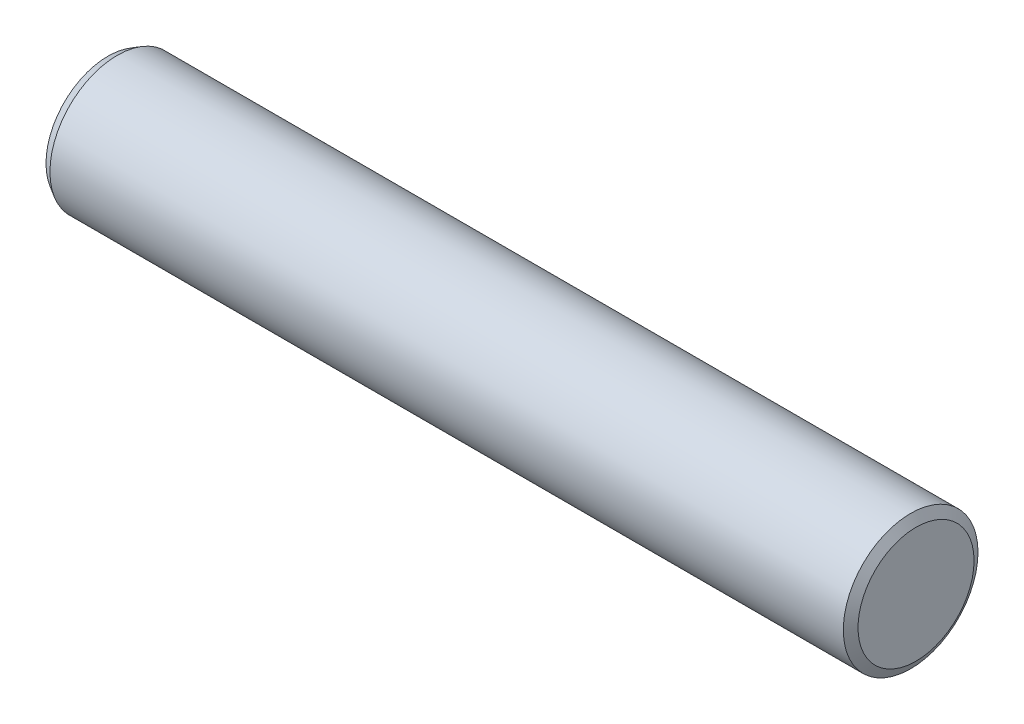
ISO-10303-21;
HEADER;
FILE_DESCRIPTION(('STEP AP214'),'2;1');
FILE_NAME('part.step','',(''),(''),'','','');
FILE_SCHEMA(('AUTOMOTIVE_DESIGN { 1 0 10303 214 1 1 1 1 }'));
ENDSEC;
DATA;
#1=APPLICATION_CONTEXT('core data for automotive mechanical design processes');
#2=APPLICATION_PROTOCOL_DEFINITION('international standard','automotive_design',2000,#1);
#3=PRODUCT_CONTEXT('',#1,'mechanical');
#4=PRODUCT('Part','Part','',(#3));
#5=PRODUCT_RELATED_PRODUCT_CATEGORY('part','',(#4));
#6=PRODUCT_DEFINITION_FORMATION('','',#4);
#7=PRODUCT_DEFINITION_CONTEXT('part definition',#1,'design');
#8=PRODUCT_DEFINITION('design','',#6,#7);
#9=PRODUCT_DEFINITION_SHAPE('','',#8);
#10=(LENGTH_UNIT() NAMED_UNIT(*) SI_UNIT(.MILLI.,.METRE.));
#11=(NAMED_UNIT(*) PLANE_ANGLE_UNIT() SI_UNIT($,.RADIAN.));
#12=(NAMED_UNIT(*) SI_UNIT($,.STERADIAN.) SOLID_ANGLE_UNIT());
#13=UNCERTAINTY_MEASURE_WITH_UNIT(LENGTH_MEASURE(1.E-05),#10,'distance_accuracy_value','');
#14=(GEOMETRIC_REPRESENTATION_CONTEXT(3) GLOBAL_UNCERTAINTY_ASSIGNED_CONTEXT((#13)) GLOBAL_UNIT_ASSIGNED_CONTEXT((#10,
#11,#12)) REPRESENTATION_CONTEXT('',''));
#15=CARTESIAN_POINT('',(0.,0.,0.));
#16=DIRECTION('',(0.,0.,1.));
#17=DIRECTION('',(1.,0.,0.));
#18=AXIS2_PLACEMENT_3D('',#15,#16,#17);
#19=CARTESIAN_POINT('',(0.,0.,0.));
#20=DIRECTION('',(1.,0.,0.));
#21=DIRECTION('',(0.,0.,-1.));
#22=AXIS2_PLACEMENT_3D('',#19,#20,#21);
#23=PLANE('',#22);
#24=CARTESIAN_POINT('',(0.,0.,0.));
#25=DIRECTION('',(1.,0.,0.));
#26=DIRECTION('',(0.,0.,-1.));
#27=AXIS2_PLACEMENT_3D('',#24,#25,#26);
#28=CIRCLE('',#27,2.15358983848623);
#29=CARTESIAN_POINT('',(0.,0.,-2.15358983848623));
#30=VERTEX_POINT('',#29);
#31=EDGE_CURVE('E10',#30,#30,#28,.T.);
#32=ORIENTED_EDGE('',*,*,#31,.T.);
#33=EDGE_LOOP('',(#32));
#34=FACE_BOUND('',#33,.T.);
#35=ADVANCED_FACE('F36',(#34),#23,.T.);
#36=CARTESIAN_POINT('',(0.,0.,0.));
#37=DIRECTION('',(1.,0.,0.));
#38=DIRECTION('',(0.,0.,-1.));
#39=AXIS2_PLACEMENT_3D('',#36,#37,#38);
#40=CYLINDRICAL_SURFACE('',#39,2.5);
#41=CARTESIAN_POINT('',(-29.6535898384862,0.,0.));
#42=DIRECTION('',(-1.,0.,0.));
#43=DIRECTION('',(0.,0.,1.));
#44=AXIS2_PLACEMENT_3D('',#41,#42,#43);
#45=CIRCLE('',#44,2.5);
#46=CARTESIAN_POINT('',(-29.6535898384862,0.,2.5));
#47=VERTEX_POINT('',#46);
#48=EDGE_CURVE('E48',#47,#47,#45,.F.);
#49=ORIENTED_EDGE('',*,*,#48,.T.);
#50=EDGE_LOOP('',(#49));
#51=FACE_BOUND('',#50,.T.);
#52=CARTESIAN_POINT('',(-0.200000000000001,0.,0.));
#53=DIRECTION('',(1.,0.,0.));
#54=DIRECTION('',(0.,0.,-1.));
#55=AXIS2_PLACEMENT_3D('',#52,#53,#54);
#56=CIRCLE('',#55,2.5);
#57=CARTESIAN_POINT('',(-0.200000000000001,0.,-2.5));
#58=VERTEX_POINT('',#57);
#59=EDGE_CURVE('E52',#58,#58,#56,.F.);
#60=ORIENTED_EDGE('',*,*,#59,.T.);
#61=EDGE_LOOP('',(#60));
#62=FACE_BOUND('',#61,.T.);
#63=ADVANCED_FACE('F58',(#51,#62),#40,.T.);
#64=CARTESIAN_POINT('',(-30.,0.,0.));
#65=DIRECTION('',(-1.,0.,0.));
#66=DIRECTION('',(0.,0.,1.));
#67=AXIS2_PLACEMENT_3D('',#64,#65,#66);
#68=PLANE('',#67);
#69=CARTESIAN_POINT('',(-30.,0.,0.));
#70=DIRECTION('',(-1.,0.,0.));
#71=DIRECTION('',(0.,0.,1.));
#72=AXIS2_PLACEMENT_3D('',#69,#70,#71);
#73=CIRCLE('',#72,2.29999999999999);
#74=CARTESIAN_POINT('',(-30.,0.,2.29999999999999));
#75=VERTEX_POINT('',#74);
#76=EDGE_CURVE('E44',#75,#75,#73,.T.);
#77=ORIENTED_EDGE('',*,*,#76,.T.);
#78=EDGE_LOOP('',(#77));
#79=FACE_BOUND('',#78,.T.);
#80=ADVANCED_FACE('F66',(#79),#68,.T.);
#81=CARTESIAN_POINT('',(-29.6535898384862,0.,0.));
#82=DIRECTION('',(1.,0.,0.));
#83=DIRECTION('',(0.,0.,-1.));
#84=AXIS2_PLACEMENT_3D('',#81,#82,#83);
#85=CONICAL_SURFACE('',#84,2.5,0.523598775598301);
#86=ORIENTED_EDGE('',*,*,#76,.F.);
#87=EDGE_LOOP('',(#86));
#88=FACE_BOUND('',#87,.T.);
#89=ORIENTED_EDGE('',*,*,#48,.F.);
#90=EDGE_LOOP('',(#89));
#91=FACE_BOUND('',#90,.T.);
#92=ADVANCED_FACE('F62',(#88,#91),#85,.T.);
#93=CARTESIAN_POINT('',(0.,0.,0.));
#94=DIRECTION('',(-1.,0.,0.));
#95=DIRECTION('',(0.,0.,1.));
#96=AXIS2_PLACEMENT_3D('',#93,#94,#95);
#97=CONICAL_SURFACE('',#96,2.15358983848623,1.04719755119659);
#98=ORIENTED_EDGE('',*,*,#59,.F.);
#99=EDGE_LOOP('',(#98));
#100=FACE_BOUND('',#99,.T.);
#101=ORIENTED_EDGE('',*,*,#31,.F.);
#102=EDGE_LOOP('',(#101));
#103=FACE_BOUND('',#102,.T.);
#104=ADVANCED_FACE('F39',(#100,#103),#97,.T.);
#105=CLOSED_SHELL('',(#35,#63,#80,#92,#104));
#106=MANIFOLD_SOLID_BREP('B2',#105);
#107=ADVANCED_BREP_SHAPE_REPRESENTATION('',(#18,#106),#14);
#108=SHAPE_DEFINITION_REPRESENTATION(#9,#107);
ENDSEC;
END-ISO-10303-21;
